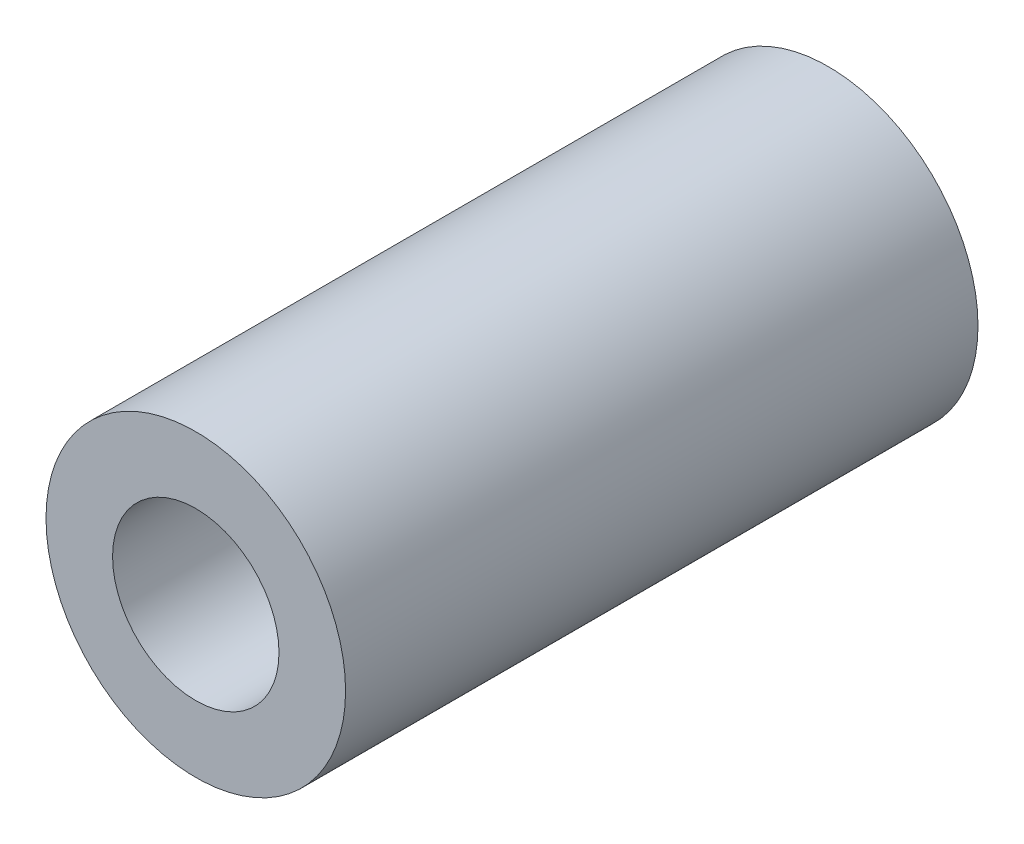
ISO-10303-21;
HEADER;
FILE_DESCRIPTION(('STEP AP214'),'2;1');
FILE_NAME('part.step','',(''),(''),'','','');
FILE_SCHEMA(('AUTOMOTIVE_DESIGN { 1 0 10303 214 1 1 1 1 }'));
ENDSEC;
DATA;
#1=APPLICATION_CONTEXT('core data for automotive mechanical design processes');
#2=APPLICATION_PROTOCOL_DEFINITION('international standard','automotive_design',2000,#1);
#3=PRODUCT_CONTEXT('',#1,'mechanical');
#4=PRODUCT('Part','Part','',(#3));
#5=PRODUCT_RELATED_PRODUCT_CATEGORY('part','',(#4));
#6=PRODUCT_DEFINITION_FORMATION('','',#4);
#7=PRODUCT_DEFINITION_CONTEXT('part definition',#1,'design');
#8=PRODUCT_DEFINITION('design','',#6,#7);
#9=PRODUCT_DEFINITION_SHAPE('','',#8);
#10=(LENGTH_UNIT() NAMED_UNIT(*) SI_UNIT(.MILLI.,.METRE.));
#11=(NAMED_UNIT(*) PLANE_ANGLE_UNIT() SI_UNIT($,.RADIAN.));
#12=(NAMED_UNIT(*) SI_UNIT($,.STERADIAN.) SOLID_ANGLE_UNIT());
#13=UNCERTAINTY_MEASURE_WITH_UNIT(LENGTH_MEASURE(1.E-05),#10,'distance_accuracy_value','');
#14=(GEOMETRIC_REPRESENTATION_CONTEXT(3) GLOBAL_UNCERTAINTY_ASSIGNED_CONTEXT((#13)) GLOBAL_UNIT_ASSIGNED_CONTEXT((#10,
#11,#12)) REPRESENTATION_CONTEXT('',''));
#15=CARTESIAN_POINT('',(0.,0.,0.));
#16=DIRECTION('',(0.,0.,1.));
#17=DIRECTION('',(1.,0.,0.));
#18=AXIS2_PLACEMENT_3D('',#15,#16,#17);
#19=CARTESIAN_POINT('',(0.,0.,19.));
#20=DIRECTION('',(0.,0.,1.));
#21=DIRECTION('',(1.,0.,0.));
#22=AXIS2_PLACEMENT_3D('',#19,#20,#21);
#23=PLANE('',#22);
#24=CARTESIAN_POINT('',(0.,0.,19.));
#25=DIRECTION('',(0.,0.,1.));
#26=DIRECTION('',(1.,0.,0.));
#27=AXIS2_PLACEMENT_3D('',#24,#25,#26);
#28=CIRCLE('',#27,4.5);
#29=CARTESIAN_POINT('',(4.5,0.,19.));
#30=VERTEX_POINT('',#29);
#31=EDGE_CURVE('E10',#30,#30,#28,.T.);
#32=ORIENTED_EDGE('',*,*,#31,.T.);
#33=EDGE_LOOP('',(#32));
#34=FACE_BOUND('',#33,.T.);
#35=CARTESIAN_POINT('',(0.,0.,19.));
#36=DIRECTION('',(0.,0.,1.));
#37=DIRECTION('',(1.,0.,0.));
#38=AXIS2_PLACEMENT_3D('',#35,#36,#37);
#39=CIRCLE('',#38,2.5);
#40=CARTESIAN_POINT('',(2.5,0.,19.));
#41=VERTEX_POINT('',#40);
#42=EDGE_CURVE('E43',#41,#41,#39,.T.);
#43=ORIENTED_EDGE('',*,*,#42,.F.);
#44=EDGE_LOOP('',(#43));
#45=FACE_BOUND('',#44,.T.);
#46=ADVANCED_FACE('F32',(#34,#45),#23,.T.);
#47=CARTESIAN_POINT('',(0.,0.,0.));
#48=DIRECTION('',(0.,0.,1.));
#49=DIRECTION('',(1.,0.,0.));
#50=AXIS2_PLACEMENT_3D('',#47,#48,#49);
#51=PLANE('',#50);
#52=CARTESIAN_POINT('',(0.,0.,0.));
#53=DIRECTION('',(0.,0.,1.));
#54=DIRECTION('',(1.,0.,0.));
#55=AXIS2_PLACEMENT_3D('',#52,#53,#54);
#56=CIRCLE('',#55,4.5);
#57=CARTESIAN_POINT('',(4.5,0.,0.));
#58=VERTEX_POINT('',#57);
#59=EDGE_CURVE('E36',#58,#58,#56,.T.);
#60=ORIENTED_EDGE('',*,*,#59,.F.);
#61=EDGE_LOOP('',(#60));
#62=FACE_BOUND('',#61,.T.);
#63=CARTESIAN_POINT('',(0.,0.,0.));
#64=DIRECTION('',(0.,0.,1.));
#65=DIRECTION('',(1.,0.,0.));
#66=AXIS2_PLACEMENT_3D('',#63,#64,#65);
#67=CIRCLE('',#66,2.5);
#68=CARTESIAN_POINT('',(2.5,0.,0.));
#69=VERTEX_POINT('',#68);
#70=EDGE_CURVE('E45',#69,#69,#67,.T.);
#71=ORIENTED_EDGE('',*,*,#70,.T.);
#72=EDGE_LOOP('',(#71));
#73=FACE_BOUND('',#72,.T.);
#74=ADVANCED_FACE('F55',(#62,#73),#51,.F.);
#75=CARTESIAN_POINT('',(0.,0.,19.));
#76=DIRECTION('',(0.,0.,-1.));
#77=DIRECTION('',(-1.,0.,0.));
#78=AXIS2_PLACEMENT_3D('',#75,#76,#77);
#79=CYLINDRICAL_SURFACE('',#78,4.5);
#80=ORIENTED_EDGE('',*,*,#31,.F.);
#81=EDGE_LOOP('',(#80));
#82=FACE_BOUND('',#81,.T.);
#83=ORIENTED_EDGE('',*,*,#59,.T.);
#84=EDGE_LOOP('',(#83));
#85=FACE_BOUND('',#84,.T.);
#86=ADVANCED_FACE('F34',(#82,#85),#79,.T.);
#87=CARTESIAN_POINT('',(0.,0.,19.));
#88=DIRECTION('',(0.,0.,-1.));
#89=DIRECTION('',(-1.,0.,0.));
#90=AXIS2_PLACEMENT_3D('',#87,#88,#89);
#91=CYLINDRICAL_SURFACE('',#90,2.5);
#92=ORIENTED_EDGE('',*,*,#42,.T.);
#93=EDGE_LOOP('',(#92));
#94=FACE_BOUND('',#93,.T.);
#95=ORIENTED_EDGE('',*,*,#70,.F.);
#96=EDGE_LOOP('',(#95));
#97=FACE_BOUND('',#96,.T.);
#98=ADVANCED_FACE('F51',(#94,#97),#91,.F.);
#99=CLOSED_SHELL('',(#46,#74,#86,#98));
#100=MANIFOLD_SOLID_BREP('B2',#99);
#101=ADVANCED_BREP_SHAPE_REPRESENTATION('',(#18,#100),#14);
#102=SHAPE_DEFINITION_REPRESENTATION(#9,#101);
ENDSEC;
END-ISO-10303-21;
